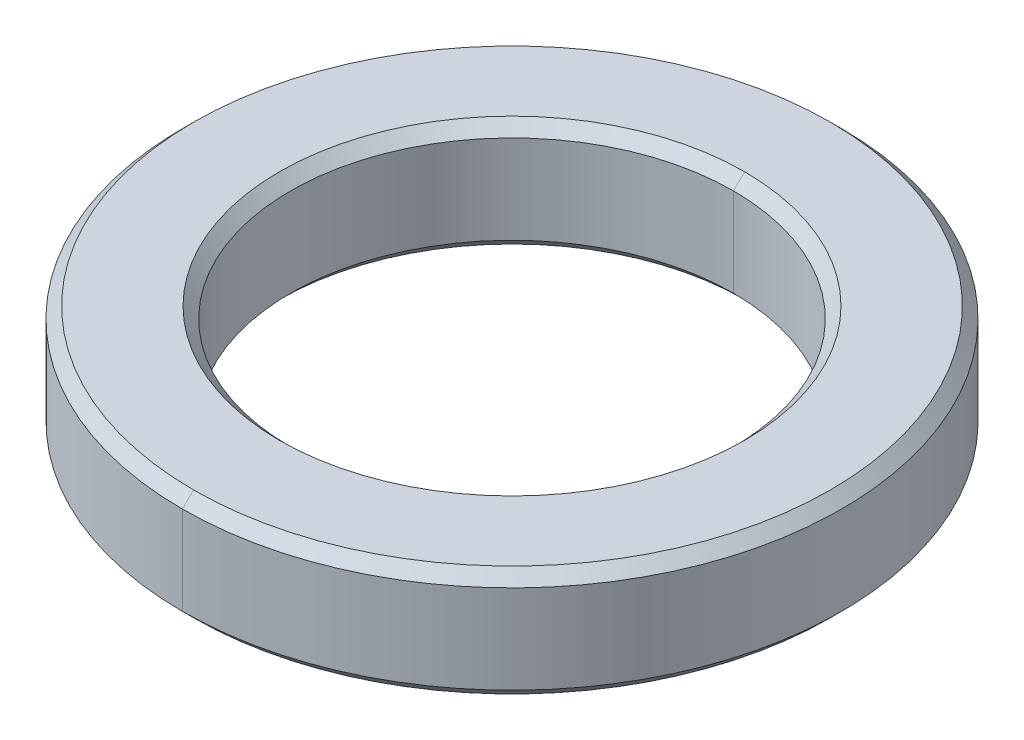
ISO-10303-21;
HEADER;
FILE_DESCRIPTION(('STEP AP214'),'2;1');
FILE_NAME('part.step','',(''),(''),'','','');
FILE_SCHEMA(('AUTOMOTIVE_DESIGN { 1 0 10303 214 1 1 1 1 }'));
ENDSEC;
DATA;
#1=APPLICATION_CONTEXT('core data for automotive mechanical design processes');
#2=APPLICATION_PROTOCOL_DEFINITION('international standard','automotive_design',2000,#1);
#3=PRODUCT_CONTEXT('',#1,'mechanical');
#4=PRODUCT('Part','Part','',(#3));
#5=PRODUCT_RELATED_PRODUCT_CATEGORY('part','',(#4));
#6=PRODUCT_DEFINITION_FORMATION('','',#4);
#7=PRODUCT_DEFINITION_CONTEXT('part definition',#1,'design');
#8=PRODUCT_DEFINITION('design','',#6,#7);
#9=PRODUCT_DEFINITION_SHAPE('','',#8);
#10=(LENGTH_UNIT() NAMED_UNIT(*) SI_UNIT(.MILLI.,.METRE.));
#11=(NAMED_UNIT(*) PLANE_ANGLE_UNIT() SI_UNIT($,.RADIAN.));
#12=(NAMED_UNIT(*) SI_UNIT($,.STERADIAN.) SOLID_ANGLE_UNIT());
#13=UNCERTAINTY_MEASURE_WITH_UNIT(LENGTH_MEASURE(1.E-05),#10,'distance_accuracy_value','');
#14=(GEOMETRIC_REPRESENTATION_CONTEXT(3) GLOBAL_UNCERTAINTY_ASSIGNED_CONTEXT((#13)) GLOBAL_UNIT_ASSIGNED_CONTEXT((#10,
#11,#12)) REPRESENTATION_CONTEXT('',''));
#15=CARTESIAN_POINT('',(0.,0.,0.));
#16=DIRECTION('',(0.,0.,1.));
#17=DIRECTION('',(1.,0.,0.));
#18=AXIS2_PLACEMENT_3D('',#15,#16,#17);
#19=CARTESIAN_POINT('',(0.,0.4,0.));
#20=DIRECTION('',(0.,1.,0.));
#21=DIRECTION('',(0.,0.,1.));
#22=AXIS2_PLACEMENT_3D('',#19,#20,#21);
#23=CONICAL_SURFACE('',#22,2.,0.785398163397452);
#24=DIRECTION('',(0.,0.707106781186545,-0.707106781186551));
#25=VECTOR('',#24,1.);
#26=CARTESIAN_POINT('',(0.,0.4,-2.));
#27=LINE('',#26,#25);
#28=CARTESIAN_POINT('',(0.,0.4,-2.));
#29=VERTEX_POINT('',#28);
#30=CARTESIAN_POINT('',(0.,0.5,-2.1));
#31=VERTEX_POINT('',#30);
#32=EDGE_CURVE('E93',#29,#31,#27,.T.);
#33=ORIENTED_EDGE('',*,*,#32,.F.);
#34=CARTESIAN_POINT('',(0.,0.4,0.));
#35=DIRECTION('',(0.,1.,0.));
#36=DIRECTION('',(0.,0.,1.));
#37=AXIS2_PLACEMENT_3D('',#34,#35,#36);
#38=CIRCLE('',#37,2.);
#39=CARTESIAN_POINT('',(0.,0.4,2.));
#40=VERTEX_POINT('',#39);
#41=EDGE_CURVE('E27',#40,#29,#38,.T.);
#42=ORIENTED_EDGE('',*,*,#41,.F.);
#43=DIRECTION('',(0.,0.707106781186545,0.707106781186551));
#44=VECTOR('',#43,1.);
#45=CARTESIAN_POINT('',(0.,0.4,2.));
#46=LINE('',#45,#44);
#47=CARTESIAN_POINT('',(0.,0.5,2.1));
#48=VERTEX_POINT('',#47);
#49=EDGE_CURVE('E84',#40,#48,#46,.T.);
#50=ORIENTED_EDGE('',*,*,#49,.T.);
#51=CARTESIAN_POINT('',(0.,0.5,0.));
#52=DIRECTION('',(0.,-1.,0.));
#53=DIRECTION('',(0.,0.,1.));
#54=AXIS2_PLACEMENT_3D('',#51,#52,#53);
#55=CIRCLE('',#54,2.1);
#56=EDGE_CURVE('E69',#31,#48,#55,.T.);
#57=ORIENTED_EDGE('',*,*,#56,.F.);
#58=EDGE_LOOP('',(#33,#42,#50,#57));
#59=FACE_BOUND('',#58,.T.);
#60=ADVANCED_FACE('F16',(#59),#23,.F.);
#61=CARTESIAN_POINT('',(0.,-0.5,0.));
#62=DIRECTION('',(0.,-1.,0.));
#63=DIRECTION('',(0.,0.,-1.));
#64=AXIS2_PLACEMENT_3D('',#61,#62,#63);
#65=CONICAL_SURFACE('',#64,2.1,0.785398163397443);
#66=DIRECTION('',(0.,-0.707106781186551,0.707106781186545));
#67=VECTOR('',#66,1.);
#68=CARTESIAN_POINT('',(0.,-0.5,2.1));
#69=LINE('',#68,#67);
#70=CARTESIAN_POINT('',(0.,-0.4,2.));
#71=VERTEX_POINT('',#70);
#72=CARTESIAN_POINT('',(0.,-0.5,2.1));
#73=VERTEX_POINT('',#72);
#74=EDGE_CURVE('E111',#71,#73,#69,.T.);
#75=ORIENTED_EDGE('',*,*,#74,.F.);
#76=CARTESIAN_POINT('',(0.,-0.4,0.));
#77=DIRECTION('',(0.,-1.,0.));
#78=DIRECTION('',(0.,0.,1.));
#79=AXIS2_PLACEMENT_3D('',#76,#77,#78);
#80=CIRCLE('',#79,2.);
#81=CARTESIAN_POINT('',(0.,-0.4,-2.));
#82=VERTEX_POINT('',#81);
#83=EDGE_CURVE('E11',#82,#71,#80,.T.);
#84=ORIENTED_EDGE('',*,*,#83,.F.);
#85=DIRECTION('',(0.,-0.707106781186551,-0.707106781186545));
#86=VECTOR('',#85,1.);
#87=CARTESIAN_POINT('',(0.,-0.5,-2.1));
#88=LINE('',#87,#86);
#89=CARTESIAN_POINT('',(0.,-0.5,-2.1));
#90=VERTEX_POINT('',#89);
#91=EDGE_CURVE('E110',#82,#90,#88,.T.);
#92=ORIENTED_EDGE('',*,*,#91,.T.);
#93=CARTESIAN_POINT('',(0.,-0.5,0.));
#94=DIRECTION('',(0.,1.,0.));
#95=DIRECTION('',(0.,0.,1.));
#96=AXIS2_PLACEMENT_3D('',#93,#94,#95);
#97=CIRCLE('',#96,2.1);
#98=EDGE_CURVE('E118',#73,#90,#97,.T.);
#99=ORIENTED_EDGE('',*,*,#98,.F.);
#100=EDGE_LOOP('',(#75,#84,#92,#99));
#101=FACE_BOUND('',#100,.T.);
#102=ADVANCED_FACE('F246',(#101),#65,.F.);
#103=CARTESIAN_POINT('',(0.,0.5,0.));
#104=DIRECTION('',(0.,-1.,0.));
#105=DIRECTION('',(0.,0.,-1.));
#106=AXIS2_PLACEMENT_3D('',#103,#104,#105);
#107=CONICAL_SURFACE('',#106,2.875,0.785398163397448);
#108=DIRECTION('',(0.,-0.707106781186548,0.707106781186548));
#109=VECTOR('',#108,1.);
#110=CARTESIAN_POINT('',(0.,0.5,2.875));
#111=LINE('',#110,#109);
#112=CARTESIAN_POINT('',(0.,0.5,2.875));
#113=VERTEX_POINT('',#112);
#114=CARTESIAN_POINT('',(0.,0.4,2.975));
#115=VERTEX_POINT('',#114);
#116=EDGE_CURVE('E162',#113,#115,#111,.T.);
#117=ORIENTED_EDGE('',*,*,#116,.F.);
#118=CARTESIAN_POINT('',(0.,0.5,0.));
#119=DIRECTION('',(0.,1.,0.));
#120=DIRECTION('',(0.,0.,1.));
#121=AXIS2_PLACEMENT_3D('',#118,#119,#120);
#122=CIRCLE('',#121,2.875);
#123=CARTESIAN_POINT('',(0.,0.5,-2.875));
#124=VERTEX_POINT('',#123);
#125=EDGE_CURVE('E80',#124,#113,#122,.T.);
#126=ORIENTED_EDGE('',*,*,#125,.F.);
#127=DIRECTION('',(0.,-0.707106781186548,-0.707106781186548));
#128=VECTOR('',#127,1.);
#129=CARTESIAN_POINT('',(0.,0.5,-2.875));
#130=LINE('',#129,#128);
#131=CARTESIAN_POINT('',(0.,0.4,-2.975));
#132=VERTEX_POINT('',#131);
#133=EDGE_CURVE('E112',#124,#132,#130,.T.);
#134=ORIENTED_EDGE('',*,*,#133,.T.);
#135=CARTESIAN_POINT('',(0.,0.4,0.));
#136=DIRECTION('',(0.,-1.,0.));
#137=DIRECTION('',(0.,0.,1.));
#138=AXIS2_PLACEMENT_3D('',#135,#136,#137);
#139=CIRCLE('',#138,2.975);
#140=EDGE_CURVE('E122',#115,#132,#139,.T.);
#141=ORIENTED_EDGE('',*,*,#140,.F.);
#142=EDGE_LOOP('',(#117,#126,#134,#141));
#143=FACE_BOUND('',#142,.T.);
#144=ADVANCED_FACE('F317',(#143),#107,.T.);
#145=CARTESIAN_POINT('',(0.,-0.4,0.));
#146=DIRECTION('',(0.,1.,0.));
#147=DIRECTION('',(0.,0.,1.));
#148=AXIS2_PLACEMENT_3D('',#145,#146,#147);
#149=CONICAL_SURFACE('',#148,2.975,0.785398163397446);
#150=DIRECTION('',(0.,0.707106781186549,-0.707106781186546));
#151=VECTOR('',#150,1.);
#152=CARTESIAN_POINT('',(0.,-0.4,-2.975));
#153=LINE('',#152,#151);
#154=CARTESIAN_POINT('',(0.,-0.5,-2.875));
#155=VERTEX_POINT('',#154);
#156=CARTESIAN_POINT('',(0.,-0.4,-2.975));
#157=VERTEX_POINT('',#156);
#158=EDGE_CURVE('E128',#155,#157,#153,.T.);
#159=ORIENTED_EDGE('',*,*,#158,.F.);
#160=CARTESIAN_POINT('',(0.,-0.5,0.));
#161=DIRECTION('',(0.,-1.,0.));
#162=DIRECTION('',(0.,0.,1.));
#163=AXIS2_PLACEMENT_3D('',#160,#161,#162);
#164=CIRCLE('',#163,2.875);
#165=CARTESIAN_POINT('',(0.,-0.5,2.875));
#166=VERTEX_POINT('',#165);
#167=EDGE_CURVE('E79',#166,#155,#164,.T.);
#168=ORIENTED_EDGE('',*,*,#167,.F.);
#169=DIRECTION('',(0.,0.707106781186549,0.707106781186546));
#170=VECTOR('',#169,1.);
#171=CARTESIAN_POINT('',(0.,-0.4,2.975));
#172=LINE('',#171,#170);
#173=CARTESIAN_POINT('',(0.,-0.4,2.975));
#174=VERTEX_POINT('',#173);
#175=EDGE_CURVE('E202',#166,#174,#172,.T.);
#176=ORIENTED_EDGE('',*,*,#175,.T.);
#177=CARTESIAN_POINT('',(0.,-0.4,0.));
#178=DIRECTION('',(0.,1.,0.));
#179=DIRECTION('',(0.,0.,1.));
#180=AXIS2_PLACEMENT_3D('',#177,#178,#179);
#181=CIRCLE('',#180,2.975);
#182=EDGE_CURVE('E42',#157,#174,#181,.T.);
#183=ORIENTED_EDGE('',*,*,#182,.F.);
#184=EDGE_LOOP('',(#159,#168,#176,#183));
#185=FACE_BOUND('',#184,.T.);
#186=ADVANCED_FACE('F254',(#185),#149,.T.);
#187=CARTESIAN_POINT('',(0.,0.5,0.));
#188=DIRECTION('',(0.,-1.,0.));
#189=DIRECTION('',(0.,0.,-1.));
#190=AXIS2_PLACEMENT_3D('',#187,#188,#189);
#191=CYLINDRICAL_SURFACE('',#190,2.);
#192=DIRECTION('',(0.,-1.,0.));
#193=VECTOR('',#192,1.);
#194=CARTESIAN_POINT('',(0.,0.5,2.));
#195=LINE('',#194,#193);
#196=EDGE_CURVE('E140',#40,#71,#195,.T.);
#197=ORIENTED_EDGE('',*,*,#196,.F.);
#198=ORIENTED_EDGE('',*,*,#41,.T.);
#199=DIRECTION('',(0.,-1.,0.));
#200=VECTOR('',#199,1.);
#201=CARTESIAN_POINT('',(0.,0.5,-2.));
#202=LINE('',#201,#200);
#203=EDGE_CURVE('E105',#29,#82,#202,.T.);
#204=ORIENTED_EDGE('',*,*,#203,.T.);
#205=ORIENTED_EDGE('',*,*,#83,.T.);
#206=EDGE_LOOP('',(#197,#198,#204,#205));
#207=FACE_BOUND('',#206,.T.);
#208=ADVANCED_FACE('F336',(#207),#191,.F.);
#209=CARTESIAN_POINT('',(0.,0.5,0.));
#210=DIRECTION('',(0.,-1.,0.));
#211=DIRECTION('',(0.,0.,-1.));
#212=AXIS2_PLACEMENT_3D('',#209,#210,#211);
#213=CYLINDRICAL_SURFACE('',#212,2.975);
#214=DIRECTION('',(0.,-1.,0.));
#215=VECTOR('',#214,1.);
#216=CARTESIAN_POINT('',(0.,0.5,2.975));
#217=LINE('',#216,#215);
#218=EDGE_CURVE('E20',#115,#174,#217,.T.);
#219=ORIENTED_EDGE('',*,*,#218,.F.);
#220=ORIENTED_EDGE('',*,*,#140,.T.);
#221=DIRECTION('',(0.,-1.,0.));
#222=VECTOR('',#221,1.);
#223=CARTESIAN_POINT('',(0.,0.5,-2.975));
#224=LINE('',#223,#222);
#225=EDGE_CURVE('E182',#132,#157,#224,.T.);
#226=ORIENTED_EDGE('',*,*,#225,.T.);
#227=ORIENTED_EDGE('',*,*,#182,.T.);
#228=EDGE_LOOP('',(#219,#220,#226,#227));
#229=FACE_BOUND('',#228,.T.);
#230=ADVANCED_FACE('F223',(#229),#213,.T.);
#231=CARTESIAN_POINT('',(0.,-0.5,0.));
#232=DIRECTION('',(0.,1.,0.));
#233=DIRECTION('',(1.,0.,0.));
#234=AXIS2_PLACEMENT_3D('',#231,#232,#233);
#235=PLANE('',#234);
#236=CARTESIAN_POINT('',(0.,-0.5,0.));
#237=DIRECTION('',(0.,1.,0.));
#238=DIRECTION('',(0.,0.,1.));
#239=AXIS2_PLACEMENT_3D('',#236,#237,#238);
#240=CIRCLE('',#239,2.1);
#241=EDGE_CURVE('E107',#90,#73,#240,.T.);
#242=ORIENTED_EDGE('',*,*,#241,.T.);
#243=ORIENTED_EDGE('',*,*,#98,.T.);
#244=EDGE_LOOP('',(#242,#243));
#245=FACE_BOUND('',#244,.T.);
#246=ORIENTED_EDGE('',*,*,#167,.T.);
#247=CARTESIAN_POINT('',(0.,-0.5,0.));
#248=DIRECTION('',(0.,-1.,0.));
#249=DIRECTION('',(0.,0.,1.));
#250=AXIS2_PLACEMENT_3D('',#247,#248,#249);
#251=CIRCLE('',#250,2.875);
#252=EDGE_CURVE('E116',#155,#166,#251,.T.);
#253=ORIENTED_EDGE('',*,*,#252,.T.);
#254=EDGE_LOOP('',(#246,#253));
#255=FACE_BOUND('',#254,.T.);
#256=ADVANCED_FACE('F248',(#245,#255),#235,.F.);
#257=CARTESIAN_POINT('',(0.,0.5,0.));
#258=DIRECTION('',(0.,1.,0.));
#259=DIRECTION('',(1.,0.,0.));
#260=AXIS2_PLACEMENT_3D('',#257,#258,#259);
#261=PLANE('',#260);
#262=CARTESIAN_POINT('',(0.,0.5,0.));
#263=DIRECTION('',(0.,-1.,0.));
#264=DIRECTION('',(0.,0.,1.));
#265=AXIS2_PLACEMENT_3D('',#262,#263,#264);
#266=CIRCLE('',#265,2.1);
#267=EDGE_CURVE('E74',#48,#31,#266,.T.);
#268=ORIENTED_EDGE('',*,*,#267,.T.);
#269=ORIENTED_EDGE('',*,*,#56,.T.);
#270=EDGE_LOOP('',(#268,#269));
#271=FACE_BOUND('',#270,.T.);
#272=ORIENTED_EDGE('',*,*,#125,.T.);
#273=CARTESIAN_POINT('',(0.,0.5,0.));
#274=DIRECTION('',(0.,1.,0.));
#275=DIRECTION('',(0.,0.,1.));
#276=AXIS2_PLACEMENT_3D('',#273,#274,#275);
#277=CIRCLE('',#276,2.875);
#278=EDGE_CURVE('E154',#113,#124,#277,.T.);
#279=ORIENTED_EDGE('',*,*,#278,.T.);
#280=EDGE_LOOP('',(#272,#279));
#281=FACE_BOUND('',#280,.T.);
#282=ADVANCED_FACE('F71',(#271,#281),#261,.T.);
#283=CARTESIAN_POINT('',(0.,0.5,0.));
#284=DIRECTION('',(0.,-1.,0.));
#285=DIRECTION('',(0.,0.,-1.));
#286=AXIS2_PLACEMENT_3D('',#283,#284,#285);
#287=CYLINDRICAL_SURFACE('',#286,2.975);
#288=CARTESIAN_POINT('',(0.,0.4,0.));
#289=DIRECTION('',(0.,-1.,0.));
#290=DIRECTION('',(0.,0.,1.));
#291=AXIS2_PLACEMENT_3D('',#288,#289,#290);
#292=CIRCLE('',#291,2.975);
#293=EDGE_CURVE('E117',#132,#115,#292,.T.);
#294=ORIENTED_EDGE('',*,*,#293,.T.);
#295=ORIENTED_EDGE('',*,*,#218,.T.);
#296=CARTESIAN_POINT('',(0.,-0.4,0.));
#297=DIRECTION('',(0.,1.,0.));
#298=DIRECTION('',(0.,0.,1.));
#299=AXIS2_PLACEMENT_3D('',#296,#297,#298);
#300=CIRCLE('',#299,2.975);
#301=EDGE_CURVE('E181',#174,#157,#300,.T.);
#302=ORIENTED_EDGE('',*,*,#301,.T.);
#303=ORIENTED_EDGE('',*,*,#225,.F.);
#304=EDGE_LOOP('',(#294,#295,#302,#303));
#305=FACE_BOUND('',#304,.T.);
#306=ADVANCED_FACE('F220',(#305),#287,.T.);
#307=CARTESIAN_POINT('',(0.,0.5,0.));
#308=DIRECTION('',(0.,-1.,0.));
#309=DIRECTION('',(0.,0.,-1.));
#310=AXIS2_PLACEMENT_3D('',#307,#308,#309);
#311=CYLINDRICAL_SURFACE('',#310,2.);
#312=CARTESIAN_POINT('',(0.,0.4,0.));
#313=DIRECTION('',(0.,1.,0.));
#314=DIRECTION('',(0.,0.,1.));
#315=AXIS2_PLACEMENT_3D('',#312,#313,#314);
#316=CIRCLE('',#315,2.);
#317=EDGE_CURVE('E101',#29,#40,#316,.T.);
#318=ORIENTED_EDGE('',*,*,#317,.T.);
#319=ORIENTED_EDGE('',*,*,#196,.T.);
#320=CARTESIAN_POINT('',(0.,-0.4,0.));
#321=DIRECTION('',(0.,-1.,0.));
#322=DIRECTION('',(0.,0.,1.));
#323=AXIS2_PLACEMENT_3D('',#320,#321,#322);
#324=CIRCLE('',#323,2.);
#325=EDGE_CURVE('E90',#71,#82,#324,.T.);
#326=ORIENTED_EDGE('',*,*,#325,.T.);
#327=ORIENTED_EDGE('',*,*,#203,.F.);
#328=EDGE_LOOP('',(#318,#319,#326,#327));
#329=FACE_BOUND('',#328,.T.);
#330=ADVANCED_FACE('F138',(#329),#311,.F.);
#331=CARTESIAN_POINT('',(0.,-0.4,0.));
#332=DIRECTION('',(0.,1.,0.));
#333=DIRECTION('',(0.,0.,1.));
#334=AXIS2_PLACEMENT_3D('',#331,#332,#333);
#335=CONICAL_SURFACE('',#334,2.975,0.785398163397446);
#336=ORIENTED_EDGE('',*,*,#252,.F.);
#337=ORIENTED_EDGE('',*,*,#158,.T.);
#338=ORIENTED_EDGE('',*,*,#301,.F.);
#339=ORIENTED_EDGE('',*,*,#175,.F.);
#340=EDGE_LOOP('',(#336,#337,#338,#339));
#341=FACE_BOUND('',#340,.T.);
#342=ADVANCED_FACE('F256',(#341),#335,.T.);
#343=CARTESIAN_POINT('',(0.,0.5,0.));
#344=DIRECTION('',(0.,-1.,0.));
#345=DIRECTION('',(0.,0.,-1.));
#346=AXIS2_PLACEMENT_3D('',#343,#344,#345);
#347=CONICAL_SURFACE('',#346,2.875,0.785398163397448);
#348=ORIENTED_EDGE('',*,*,#278,.F.);
#349=ORIENTED_EDGE('',*,*,#116,.T.);
#350=ORIENTED_EDGE('',*,*,#293,.F.);
#351=ORIENTED_EDGE('',*,*,#133,.F.);
#352=EDGE_LOOP('',(#348,#349,#350,#351));
#353=FACE_BOUND('',#352,.T.);
#354=ADVANCED_FACE('F319',(#353),#347,.T.);
#355=CARTESIAN_POINT('',(0.,-0.5,0.));
#356=DIRECTION('',(0.,-1.,0.));
#357=DIRECTION('',(0.,0.,-1.));
#358=AXIS2_PLACEMENT_3D('',#355,#356,#357);
#359=CONICAL_SURFACE('',#358,2.1,0.785398163397443);
#360=ORIENTED_EDGE('',*,*,#325,.F.);
#361=ORIENTED_EDGE('',*,*,#74,.T.);
#362=ORIENTED_EDGE('',*,*,#241,.F.);
#363=ORIENTED_EDGE('',*,*,#91,.F.);
#364=EDGE_LOOP('',(#360,#361,#362,#363));
#365=FACE_BOUND('',#364,.T.);
#366=ADVANCED_FACE('F18',(#365),#359,.F.);
#367=CARTESIAN_POINT('',(0.,0.4,0.));
#368=DIRECTION('',(0.,1.,0.));
#369=DIRECTION('',(0.,0.,1.));
#370=AXIS2_PLACEMENT_3D('',#367,#368,#369);
#371=CONICAL_SURFACE('',#370,2.,0.785398163397452);
#372=ORIENTED_EDGE('',*,*,#317,.F.);
#373=ORIENTED_EDGE('',*,*,#32,.T.);
#374=ORIENTED_EDGE('',*,*,#267,.F.);
#375=ORIENTED_EDGE('',*,*,#49,.F.);
#376=EDGE_LOOP('',(#372,#373,#374,#375));
#377=FACE_BOUND('',#376,.T.);
#378=ADVANCED_FACE('F92',(#377),#371,.F.);
#379=CLOSED_SHELL('',(#60,#102,#144,#186,#208,#230,#256,#282,#306,#330,#342,#354,#366,#378));
#380=MANIFOLD_SOLID_BREP('B1',#379);
#381=ADVANCED_BREP_SHAPE_REPRESENTATION('',(#18,#380),#14);
#382=SHAPE_DEFINITION_REPRESENTATION(#9,#381);
ENDSEC;
END-ISO-10303-21;
